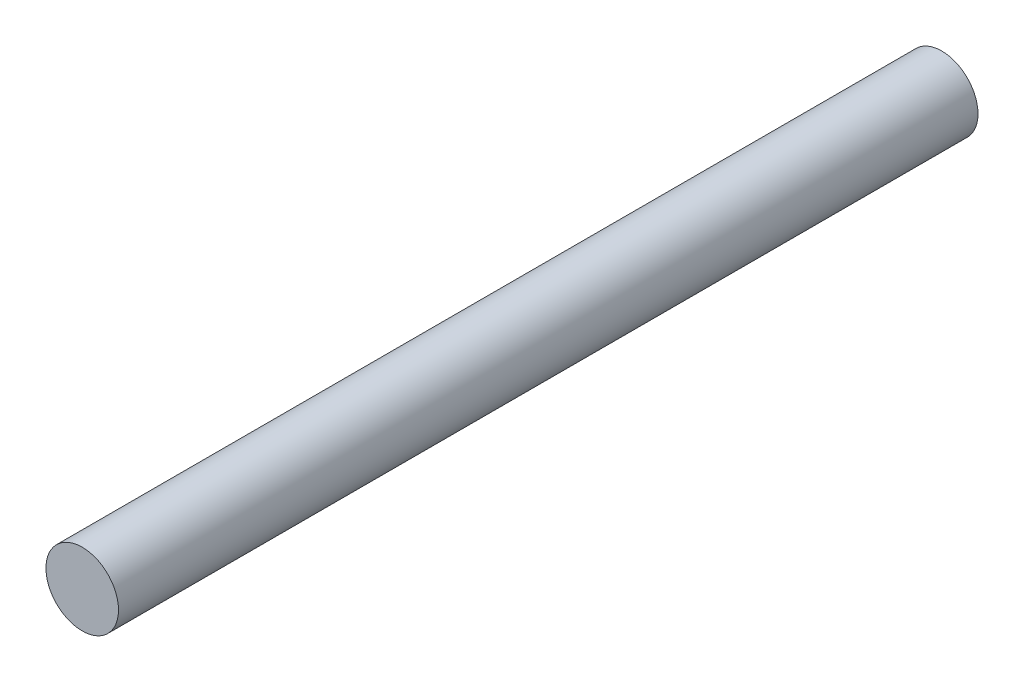
ISO-10303-21;
HEADER;
FILE_DESCRIPTION(('STEP AP214'),'2;1');
FILE_NAME('part.step','',(''),(''),'','','');
FILE_SCHEMA(('AUTOMOTIVE_DESIGN { 1 0 10303 214 1 1 1 1 }'));
ENDSEC;
DATA;
#1=APPLICATION_CONTEXT('core data for automotive mechanical design processes');
#2=APPLICATION_PROTOCOL_DEFINITION('international standard','automotive_design',2000,#1);
#3=PRODUCT_CONTEXT('',#1,'mechanical');
#4=PRODUCT('Part','Part','',(#3));
#5=PRODUCT_RELATED_PRODUCT_CATEGORY('part','',(#4));
#6=PRODUCT_DEFINITION_FORMATION('','',#4);
#7=PRODUCT_DEFINITION_CONTEXT('part definition',#1,'design');
#8=PRODUCT_DEFINITION('design','',#6,#7);
#9=PRODUCT_DEFINITION_SHAPE('','',#8);
#10=(LENGTH_UNIT() NAMED_UNIT(*) SI_UNIT(.MILLI.,.METRE.));
#11=(NAMED_UNIT(*) PLANE_ANGLE_UNIT() SI_UNIT($,.RADIAN.));
#12=(NAMED_UNIT(*) SI_UNIT($,.STERADIAN.) SOLID_ANGLE_UNIT());
#13=UNCERTAINTY_MEASURE_WITH_UNIT(LENGTH_MEASURE(1.E-05),#10,'distance_accuracy_value','');
#14=(GEOMETRIC_REPRESENTATION_CONTEXT(3) GLOBAL_UNCERTAINTY_ASSIGNED_CONTEXT((#13)) GLOBAL_UNIT_ASSIGNED_CONTEXT((#10,
#11,#12)) REPRESENTATION_CONTEXT('',''));
#15=CARTESIAN_POINT('',(0.,0.,0.));
#16=DIRECTION('',(0.,0.,1.));
#17=DIRECTION('',(1.,0.,0.));
#18=AXIS2_PLACEMENT_3D('',#15,#16,#17);
#19=CARTESIAN_POINT('',(0.,0.,90.));
#20=DIRECTION('',(0.,0.,-1.));
#21=DIRECTION('',(-1.,0.,0.));
#22=AXIS2_PLACEMENT_3D('',#19,#20,#21);
#23=CYLINDRICAL_SURFACE('',#22,3.8);
#24=CARTESIAN_POINT('',(0.,0.,90.));
#25=DIRECTION('',(0.,0.,1.));
#26=DIRECTION('',(1.,0.,0.));
#27=AXIS2_PLACEMENT_3D('',#24,#25,#26);
#28=CIRCLE('',#27,3.8);
#29=CARTESIAN_POINT('',(3.8,0.,90.));
#30=VERTEX_POINT('',#29);
#31=EDGE_CURVE('E10',#30,#30,#28,.T.);
#32=ORIENTED_EDGE('',*,*,#31,.F.);
#33=EDGE_LOOP('',(#32));
#34=FACE_BOUND('',#33,.T.);
#35=CARTESIAN_POINT('',(0.,0.,0.));
#36=DIRECTION('',(0.,0.,1.));
#37=DIRECTION('',(1.,0.,0.));
#38=AXIS2_PLACEMENT_3D('',#35,#36,#37);
#39=CIRCLE('',#38,3.8);
#40=CARTESIAN_POINT('',(3.8,0.,0.));
#41=VERTEX_POINT('',#40);
#42=EDGE_CURVE('E39',#41,#41,#39,.T.);
#43=ORIENTED_EDGE('',*,*,#42,.T.);
#44=EDGE_LOOP('',(#43));
#45=FACE_BOUND('',#44,.T.);
#46=ADVANCED_FACE('F36',(#34,#45),#23,.T.);
#47=CARTESIAN_POINT('',(0.,0.,90.));
#48=DIRECTION('',(0.,0.,1.));
#49=DIRECTION('',(1.,0.,0.));
#50=AXIS2_PLACEMENT_3D('',#47,#48,#49);
#51=PLANE('',#50);
#52=ORIENTED_EDGE('',*,*,#31,.T.);
#53=EDGE_LOOP('',(#52));
#54=FACE_BOUND('',#53,.T.);
#55=ADVANCED_FACE('F51',(#54),#51,.T.);
#56=CARTESIAN_POINT('',(0.,0.,0.));
#57=DIRECTION('',(0.,0.,1.));
#58=DIRECTION('',(1.,0.,0.));
#59=AXIS2_PLACEMENT_3D('',#56,#57,#58);
#60=PLANE('',#59);
#61=ORIENTED_EDGE('',*,*,#42,.F.);
#62=EDGE_LOOP('',(#61));
#63=FACE_BOUND('',#62,.T.);
#64=ADVANCED_FACE('F49',(#63),#60,.F.);
#65=CLOSED_SHELL('',(#46,#55,#64));
#66=MANIFOLD_SOLID_BREP('B2',#65);
#67=ADVANCED_BREP_SHAPE_REPRESENTATION('',(#18,#66),#14);
#68=SHAPE_DEFINITION_REPRESENTATION(#9,#67);
ENDSEC;
END-ISO-10303-21;
